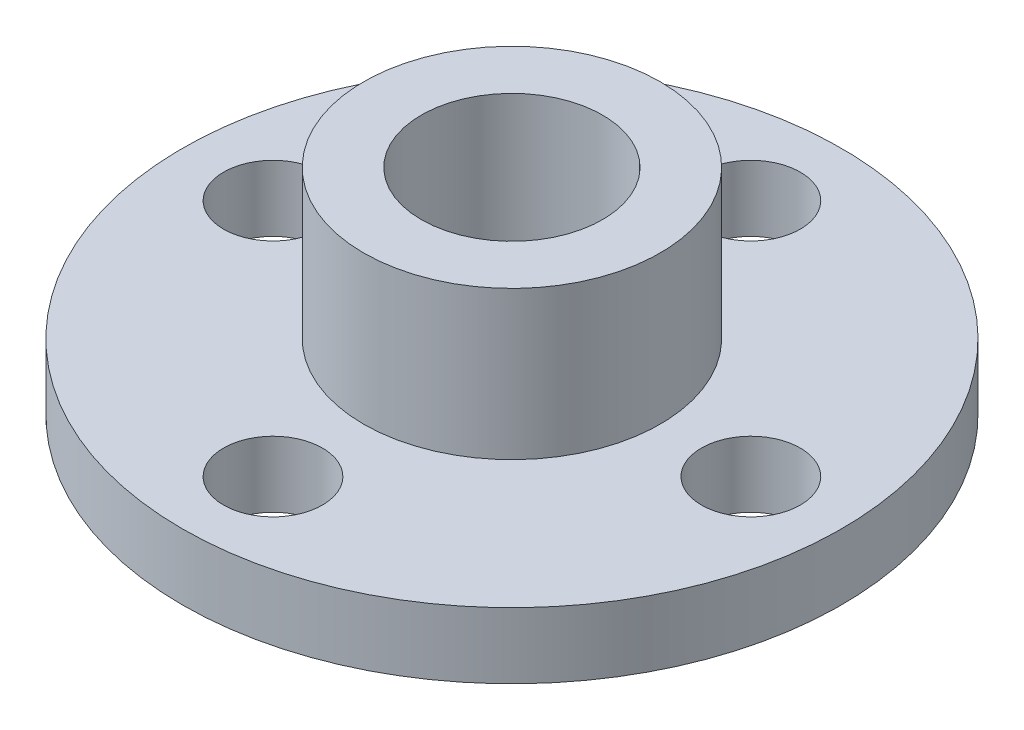
ISO-10303-21;
HEADER;
FILE_DESCRIPTION(('STEP AP214'),'2;1');
FILE_NAME('part.step','',(''),(''),'','','');
FILE_SCHEMA(('AUTOMOTIVE_DESIGN { 1 0 10303 214 1 1 1 1 }'));
ENDSEC;
DATA;
#1=APPLICATION_CONTEXT('core data for automotive mechanical design processes');
#2=APPLICATION_PROTOCOL_DEFINITION('international standard','automotive_design',2000,#1);
#3=PRODUCT_CONTEXT('',#1,'mechanical');
#4=PRODUCT('Part','Part','',(#3));
#5=PRODUCT_RELATED_PRODUCT_CATEGORY('part','',(#4));
#6=PRODUCT_DEFINITION_FORMATION('','',#4);
#7=PRODUCT_DEFINITION_CONTEXT('part definition',#1,'design');
#8=PRODUCT_DEFINITION('design','',#6,#7);
#9=PRODUCT_DEFINITION_SHAPE('','',#8);
#10=(LENGTH_UNIT() NAMED_UNIT(*) SI_UNIT(.MILLI.,.METRE.));
#11=(NAMED_UNIT(*) PLANE_ANGLE_UNIT() SI_UNIT($,.RADIAN.));
#12=(NAMED_UNIT(*) SI_UNIT($,.STERADIAN.) SOLID_ANGLE_UNIT());
#13=UNCERTAINTY_MEASURE_WITH_UNIT(LENGTH_MEASURE(1.E-05),#10,'distance_accuracy_value','');
#14=(GEOMETRIC_REPRESENTATION_CONTEXT(3) GLOBAL_UNCERTAINTY_ASSIGNED_CONTEXT((#13)) GLOBAL_UNIT_ASSIGNED_CONTEXT((#10,
#11,#12)) REPRESENTATION_CONTEXT('',''));
#15=CARTESIAN_POINT('',(0.,0.,0.));
#16=DIRECTION('',(0.,0.,1.));
#17=DIRECTION('',(1.,0.,0.));
#18=AXIS2_PLACEMENT_3D('',#15,#16,#17);
#19=CARTESIAN_POINT('',(0.,2.,0.));
#20=DIRECTION('',(0.,1.,0.));
#21=DIRECTION('',(0.,0.,1.));
#22=AXIS2_PLACEMENT_3D('',#19,#20,#21);
#23=PLANE('',#22);
#24=CARTESIAN_POINT('',(0.,2.,0.));
#25=DIRECTION('',(0.,1.,0.));
#26=DIRECTION('',(0.,0.,1.));
#27=AXIS2_PLACEMENT_3D('',#24,#25,#26);
#28=CIRCLE('',#27,2.);
#29=CARTESIAN_POINT('',(0.,2.,2.));
#30=VERTEX_POINT('',#29);
#31=EDGE_CURVE('E99',#30,#30,#28,.T.);
#32=ORIENTED_EDGE('',*,*,#31,.F.);
#33=EDGE_LOOP('',(#32));
#34=FACE_BOUND('',#33,.T.);
#35=CARTESIAN_POINT('',(0.,2.,0.));
#36=DIRECTION('',(0.,1.,0.));
#37=DIRECTION('',(0.,0.,1.));
#38=AXIS2_PLACEMENT_3D('',#35,#36,#37);
#39=CIRCLE('',#38,2.75);
#40=CARTESIAN_POINT('',(0.,2.,2.75));
#41=VERTEX_POINT('',#40);
#42=EDGE_CURVE('E11',#41,#41,#39,.F.);
#43=ORIENTED_EDGE('',*,*,#42,.F.);
#44=EDGE_LOOP('',(#43));
#45=FACE_BOUND('',#44,.T.);
#46=ADVANCED_FACE('F60',(#34,#45),#23,.T.);
#47=CARTESIAN_POINT('',(0.,2.,0.));
#48=DIRECTION('',(0.,1.,0.));
#49=DIRECTION('',(0.,0.,1.));
#50=AXIS2_PLACEMENT_3D('',#47,#48,#49);
#51=CIRCLE('',#50,4.5);
#52=CARTESIAN_POINT('',(0.,2.,4.5));
#53=VERTEX_POINT('',#52);
#54=EDGE_CURVE('E108',#53,#53,#51,.T.);
#55=ORIENTED_EDGE('',*,*,#54,.F.);
#56=EDGE_LOOP('',(#55));
#57=FACE_BOUND('',#56,.T.);
#58=CARTESIAN_POINT('',(0.,2.,-7.25));
#59=DIRECTION('',(0.,1.,0.));
#60=DIRECTION('',(0.,0.,1.));
#61=AXIS2_PLACEMENT_3D('',#58,#59,#60);
#62=CIRCLE('',#61,1.5);
#63=CARTESIAN_POINT('',(0.,2.,-5.75));
#64=VERTEX_POINT('',#63);
#65=EDGE_CURVE('E93',#64,#64,#62,.T.);
#66=ORIENTED_EDGE('',*,*,#65,.F.);
#67=EDGE_LOOP('',(#66));
#68=FACE_BOUND('',#67,.T.);
#69=CARTESIAN_POINT('',(0.,2.,7.25));
#70=DIRECTION('',(0.,1.,0.));
#71=DIRECTION('',(0.,0.,1.));
#72=AXIS2_PLACEMENT_3D('',#69,#70,#71);
#73=CIRCLE('',#72,1.5);
#74=CARTESIAN_POINT('',(0.,2.,8.75));
#75=VERTEX_POINT('',#74);
#76=EDGE_CURVE('E81',#75,#75,#73,.T.);
#77=ORIENTED_EDGE('',*,*,#76,.F.);
#78=EDGE_LOOP('',(#77));
#79=FACE_BOUND('',#78,.T.);
#80=CARTESIAN_POINT('',(0.,2.,0.));
#81=DIRECTION('',(0.,1.,0.));
#82=DIRECTION('',(0.,0.,1.));
#83=AXIS2_PLACEMENT_3D('',#80,#81,#82);
#84=CIRCLE('',#83,10.);
#85=CARTESIAN_POINT('',(0.,2.,10.));
#86=VERTEX_POINT('',#85);
#87=EDGE_CURVE('E67',#86,#86,#84,.T.);
#88=ORIENTED_EDGE('',*,*,#87,.T.);
#89=EDGE_LOOP('',(#88));
#90=FACE_BOUND('',#89,.T.);
#91=CARTESIAN_POINT('',(-7.25,2.,0.));
#92=DIRECTION('',(0.,1.,0.));
#93=DIRECTION('',(0.,0.,1.));
#94=AXIS2_PLACEMENT_3D('',#91,#92,#93);
#95=CIRCLE('',#94,1.5);
#96=CARTESIAN_POINT('',(-7.25,2.,1.5));
#97=VERTEX_POINT('',#96);
#98=EDGE_CURVE('E76',#97,#97,#95,.T.);
#99=ORIENTED_EDGE('',*,*,#98,.F.);
#100=EDGE_LOOP('',(#99));
#101=FACE_BOUND('',#100,.T.);
#102=CARTESIAN_POINT('',(7.25,2.,0.));
#103=DIRECTION('',(0.,1.,0.));
#104=DIRECTION('',(0.,0.,1.));
#105=AXIS2_PLACEMENT_3D('',#102,#103,#104);
#106=CIRCLE('',#105,1.5);
#107=CARTESIAN_POINT('',(7.25,2.,1.50000000000005));
#108=VERTEX_POINT('',#107);
#109=EDGE_CURVE('E87',#108,#108,#106,.T.);
#110=ORIENTED_EDGE('',*,*,#109,.F.);
#111=EDGE_LOOP('',(#110));
#112=FACE_BOUND('',#111,.T.);
#113=ADVANCED_FACE('F136',(#57,#68,#79,#90,#101,#112),#23,.T.);
#114=CARTESIAN_POINT('',(0.,0.,0.));
#115=DIRECTION('',(0.,1.,0.));
#116=DIRECTION('',(0.,0.,1.));
#117=AXIS2_PLACEMENT_3D('',#114,#115,#116);
#118=PLANE('',#117);
#119=CARTESIAN_POINT('',(0.,0.,0.));
#120=DIRECTION('',(0.,1.,0.));
#121=DIRECTION('',(0.,0.,1.));
#122=AXIS2_PLACEMENT_3D('',#119,#120,#121);
#123=CIRCLE('',#122,10.);
#124=CARTESIAN_POINT('',(0.,0.,10.));
#125=VERTEX_POINT('',#124);
#126=EDGE_CURVE('E71',#125,#125,#123,.T.);
#127=ORIENTED_EDGE('',*,*,#126,.F.);
#128=EDGE_LOOP('',(#127));
#129=FACE_BOUND('',#128,.T.);
#130=CARTESIAN_POINT('',(-7.25,0.,0.));
#131=DIRECTION('',(0.,1.,0.));
#132=DIRECTION('',(0.,0.,1.));
#133=AXIS2_PLACEMENT_3D('',#130,#131,#132);
#134=CIRCLE('',#133,1.5);
#135=CARTESIAN_POINT('',(-7.25,0.,1.5));
#136=VERTEX_POINT('',#135);
#137=EDGE_CURVE('E78',#136,#136,#134,.T.);
#138=ORIENTED_EDGE('',*,*,#137,.T.);
#139=EDGE_LOOP('',(#138));
#140=FACE_BOUND('',#139,.T.);
#141=CARTESIAN_POINT('',(0.,0.,7.25));
#142=DIRECTION('',(0.,1.,0.));
#143=DIRECTION('',(0.,0.,1.));
#144=AXIS2_PLACEMENT_3D('',#141,#142,#143);
#145=CIRCLE('',#144,1.5);
#146=CARTESIAN_POINT('',(0.,0.,8.75));
#147=VERTEX_POINT('',#146);
#148=EDGE_CURVE('E84',#147,#147,#145,.T.);
#149=ORIENTED_EDGE('',*,*,#148,.T.);
#150=EDGE_LOOP('',(#149));
#151=FACE_BOUND('',#150,.T.);
#152=CARTESIAN_POINT('',(7.25,0.,0.));
#153=DIRECTION('',(0.,1.,0.));
#154=DIRECTION('',(0.,0.,1.));
#155=AXIS2_PLACEMENT_3D('',#152,#153,#154);
#156=CIRCLE('',#155,1.5);
#157=CARTESIAN_POINT('',(7.25,0.,1.50000000000005));
#158=VERTEX_POINT('',#157);
#159=EDGE_CURVE('E90',#158,#158,#156,.T.);
#160=ORIENTED_EDGE('',*,*,#159,.T.);
#161=EDGE_LOOP('',(#160));
#162=FACE_BOUND('',#161,.T.);
#163=CARTESIAN_POINT('',(0.,0.,-7.25));
#164=DIRECTION('',(0.,1.,0.));
#165=DIRECTION('',(0.,0.,1.));
#166=AXIS2_PLACEMENT_3D('',#163,#164,#165);
#167=CIRCLE('',#166,1.5);
#168=CARTESIAN_POINT('',(0.,0.,-5.75));
#169=VERTEX_POINT('',#168);
#170=EDGE_CURVE('E96',#169,#169,#167,.T.);
#171=ORIENTED_EDGE('',*,*,#170,.T.);
#172=EDGE_LOOP('',(#171));
#173=FACE_BOUND('',#172,.T.);
#174=CARTESIAN_POINT('',(0.,0.,0.));
#175=DIRECTION('',(0.,1.,0.));
#176=DIRECTION('',(0.,0.,1.));
#177=AXIS2_PLACEMENT_3D('',#174,#175,#176);
#178=CIRCLE('',#177,2.);
#179=CARTESIAN_POINT('',(0.,0.,2.));
#180=VERTEX_POINT('',#179);
#181=EDGE_CURVE('E102',#180,#180,#178,.T.);
#182=ORIENTED_EDGE('',*,*,#181,.T.);
#183=EDGE_LOOP('',(#182));
#184=FACE_BOUND('',#183,.T.);
#185=ADVANCED_FACE('F142',(#129,#140,#151,#162,#173,#184),#118,.F.);
#186=CARTESIAN_POINT('',(0.,2.,0.));
#187=DIRECTION('',(0.,-1.,0.));
#188=DIRECTION('',(0.,0.,-1.));
#189=AXIS2_PLACEMENT_3D('',#186,#187,#188);
#190=CYLINDRICAL_SURFACE('',#189,10.);
#191=ORIENTED_EDGE('',*,*,#87,.F.);
#192=EDGE_LOOP('',(#191));
#193=FACE_BOUND('',#192,.T.);
#194=ORIENTED_EDGE('',*,*,#126,.T.);
#195=EDGE_LOOP('',(#194));
#196=FACE_BOUND('',#195,.T.);
#197=ADVANCED_FACE('F62',(#193,#196),#190,.T.);
#198=CARTESIAN_POINT('',(-7.25,2.,0.));
#199=DIRECTION('',(0.,-1.,0.));
#200=DIRECTION('',(0.,0.,-1.));
#201=AXIS2_PLACEMENT_3D('',#198,#199,#200);
#202=CYLINDRICAL_SURFACE('',#201,1.5);
#203=ORIENTED_EDGE('',*,*,#98,.T.);
#204=EDGE_LOOP('',(#203));
#205=FACE_BOUND('',#204,.T.);
#206=ORIENTED_EDGE('',*,*,#137,.F.);
#207=EDGE_LOOP('',(#206));
#208=FACE_BOUND('',#207,.T.);
#209=ADVANCED_FACE('F147',(#205,#208),#202,.F.);
#210=CARTESIAN_POINT('',(0.,2.,7.25));
#211=DIRECTION('',(0.,-1.,0.));
#212=DIRECTION('',(0.,0.,-1.));
#213=AXIS2_PLACEMENT_3D('',#210,#211,#212);
#214=CYLINDRICAL_SURFACE('',#213,1.5);
#215=ORIENTED_EDGE('',*,*,#76,.T.);
#216=EDGE_LOOP('',(#215));
#217=FACE_BOUND('',#216,.T.);
#218=ORIENTED_EDGE('',*,*,#148,.F.);
#219=EDGE_LOOP('',(#218));
#220=FACE_BOUND('',#219,.T.);
#221=ADVANCED_FACE('F175',(#217,#220),#214,.F.);
#222=CARTESIAN_POINT('',(7.25,2.,0.));
#223=DIRECTION('',(0.,-1.,0.));
#224=DIRECTION('',(0.,0.,-1.));
#225=AXIS2_PLACEMENT_3D('',#222,#223,#224);
#226=CYLINDRICAL_SURFACE('',#225,1.5);
#227=ORIENTED_EDGE('',*,*,#109,.T.);
#228=EDGE_LOOP('',(#227));
#229=FACE_BOUND('',#228,.T.);
#230=ORIENTED_EDGE('',*,*,#159,.F.);
#231=EDGE_LOOP('',(#230));
#232=FACE_BOUND('',#231,.T.);
#233=ADVANCED_FACE('F169',(#229,#232),#226,.F.);
#234=CARTESIAN_POINT('',(0.,2.,-7.25));
#235=DIRECTION('',(0.,-1.,0.));
#236=DIRECTION('',(0.,0.,-1.));
#237=AXIS2_PLACEMENT_3D('',#234,#235,#236);
#238=CYLINDRICAL_SURFACE('',#237,1.5);
#239=ORIENTED_EDGE('',*,*,#65,.T.);
#240=EDGE_LOOP('',(#239));
#241=FACE_BOUND('',#240,.T.);
#242=ORIENTED_EDGE('',*,*,#170,.F.);
#243=EDGE_LOOP('',(#242));
#244=FACE_BOUND('',#243,.T.);
#245=ADVANCED_FACE('F131',(#241,#244),#238,.F.);
#246=CARTESIAN_POINT('',(0.,2.,0.));
#247=DIRECTION('',(0.,-1.,0.));
#248=DIRECTION('',(0.,0.,-1.));
#249=AXIS2_PLACEMENT_3D('',#246,#247,#248);
#250=CYLINDRICAL_SURFACE('',#249,2.);
#251=ORIENTED_EDGE('',*,*,#31,.T.);
#252=EDGE_LOOP('',(#251));
#253=FACE_BOUND('',#252,.T.);
#254=ORIENTED_EDGE('',*,*,#181,.F.);
#255=EDGE_LOOP('',(#254));
#256=FACE_BOUND('',#255,.T.);
#257=ADVANCED_FACE('F122',(#253,#256),#250,.F.);
#258=CARTESIAN_POINT('',(0.,6.5,0.));
#259=DIRECTION('',(0.,1.,0.));
#260=DIRECTION('',(0.,0.,1.));
#261=AXIS2_PLACEMENT_3D('',#258,#259,#260);
#262=PLANE('',#261);
#263=CARTESIAN_POINT('',(0.,6.5,0.));
#264=DIRECTION('',(0.,1.,0.));
#265=DIRECTION('',(0.,0.,1.));
#266=AXIS2_PLACEMENT_3D('',#263,#264,#265);
#267=CIRCLE('',#266,4.5);
#268=CARTESIAN_POINT('',(0.,6.5,4.5));
#269=VERTEX_POINT('',#268);
#270=EDGE_CURVE('E105',#269,#269,#267,.T.);
#271=ORIENTED_EDGE('',*,*,#270,.T.);
#272=EDGE_LOOP('',(#271));
#273=FACE_BOUND('',#272,.T.);
#274=CARTESIAN_POINT('',(0.,6.5,0.));
#275=DIRECTION('',(0.,1.,0.));
#276=DIRECTION('',(0.,0.,1.));
#277=AXIS2_PLACEMENT_3D('',#274,#275,#276);
#278=CIRCLE('',#277,2.75);
#279=CARTESIAN_POINT('',(0.,6.5,2.75));
#280=VERTEX_POINT('',#279);
#281=EDGE_CURVE('E111',#280,#280,#278,.T.);
#282=ORIENTED_EDGE('',*,*,#281,.F.);
#283=EDGE_LOOP('',(#282));
#284=FACE_BOUND('',#283,.T.);
#285=ADVANCED_FACE('F119',(#273,#284),#262,.T.);
#286=CARTESIAN_POINT('',(0.,6.5,0.));
#287=DIRECTION('',(0.,-1.,0.));
#288=DIRECTION('',(0.,0.,-1.));
#289=AXIS2_PLACEMENT_3D('',#286,#287,#288);
#290=CYLINDRICAL_SURFACE('',#289,4.5);
#291=ORIENTED_EDGE('',*,*,#270,.F.);
#292=EDGE_LOOP('',(#291));
#293=FACE_BOUND('',#292,.T.);
#294=ORIENTED_EDGE('',*,*,#54,.T.);
#295=EDGE_LOOP('',(#294));
#296=FACE_BOUND('',#295,.T.);
#297=ADVANCED_FACE('F121',(#293,#296),#290,.T.);
#298=CARTESIAN_POINT('',(0.,6.5,0.));
#299=DIRECTION('',(0.,-1.,0.));
#300=DIRECTION('',(0.,0.,-1.));
#301=AXIS2_PLACEMENT_3D('',#298,#299,#300);
#302=CYLINDRICAL_SURFACE('',#301,2.75);
#303=ORIENTED_EDGE('',*,*,#281,.T.);
#304=EDGE_LOOP('',(#303));
#305=FACE_BOUND('',#304,.T.);
#306=ORIENTED_EDGE('',*,*,#42,.T.);
#307=EDGE_LOOP('',(#306));
#308=FACE_BOUND('',#307,.T.);
#309=ADVANCED_FACE('F117',(#305,#308),#302,.F.);
#310=CLOSED_SHELL('',(#46,#113,#185,#197,#209,#221,#233,#245,#257,#285,#297,#309));
#311=MANIFOLD_SOLID_BREP('B2',#310);
#312=ADVANCED_BREP_SHAPE_REPRESENTATION('',(#18,#311),#14);
#313=SHAPE_DEFINITION_REPRESENTATION(#9,#312);
ENDSEC;
END-ISO-10303-21;
